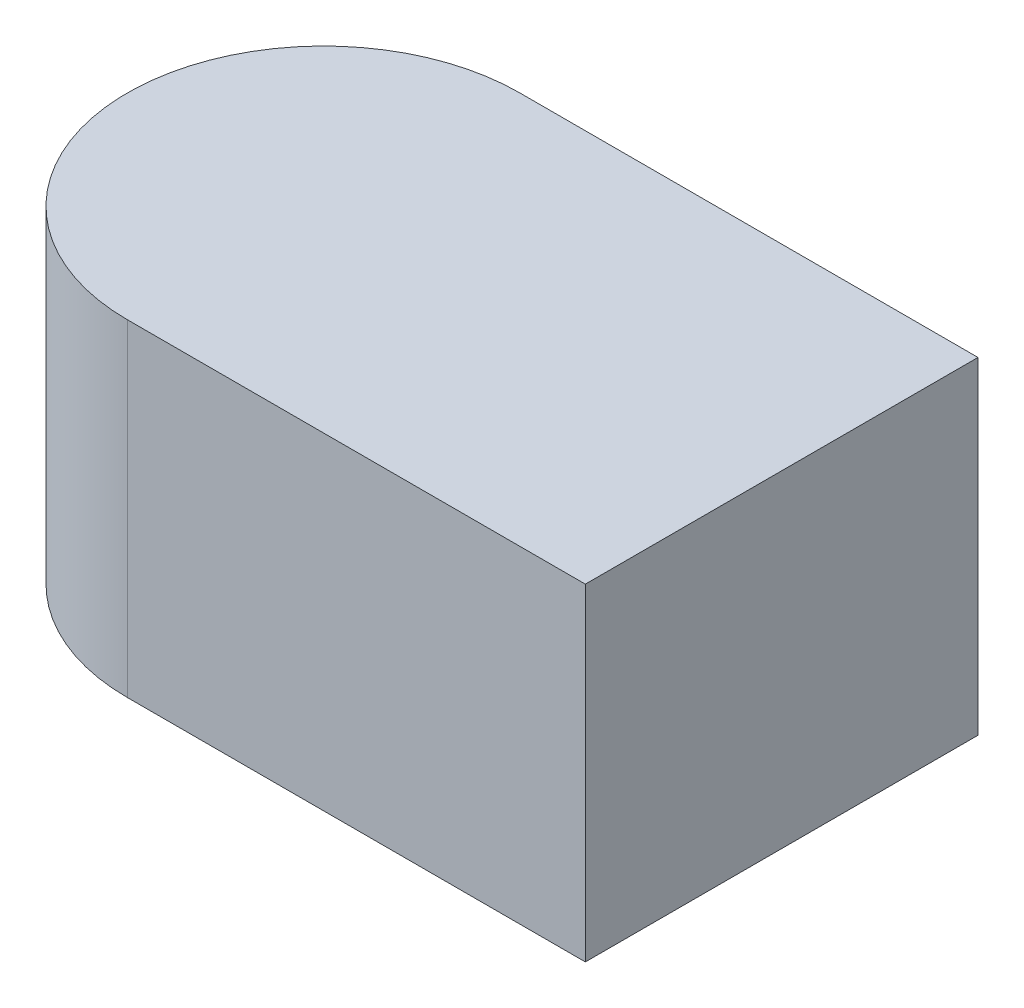
ISO-10303-21;
HEADER;
FILE_DESCRIPTION(('STEP AP214'),'2;1');
FILE_NAME('part.step','',(''),(''),'','','');
FILE_SCHEMA(('AUTOMOTIVE_DESIGN { 1 0 10303 214 1 1 1 1 }'));
ENDSEC;
DATA;
#1=APPLICATION_CONTEXT('core data for automotive mechanical design processes');
#2=APPLICATION_PROTOCOL_DEFINITION('international standard','automotive_design',2000,#1);
#3=PRODUCT_CONTEXT('',#1,'mechanical');
#4=PRODUCT('Part','Part','',(#3));
#5=PRODUCT_RELATED_PRODUCT_CATEGORY('part','',(#4));
#6=PRODUCT_DEFINITION_FORMATION('','',#4);
#7=PRODUCT_DEFINITION_CONTEXT('part definition',#1,'design');
#8=PRODUCT_DEFINITION('design','',#6,#7);
#9=PRODUCT_DEFINITION_SHAPE('','',#8);
#10=(LENGTH_UNIT() NAMED_UNIT(*) SI_UNIT(.MILLI.,.METRE.));
#11=(NAMED_UNIT(*) PLANE_ANGLE_UNIT() SI_UNIT($,.RADIAN.));
#12=(NAMED_UNIT(*) SI_UNIT($,.STERADIAN.) SOLID_ANGLE_UNIT());
#13=UNCERTAINTY_MEASURE_WITH_UNIT(LENGTH_MEASURE(1.E-05),#10,'distance_accuracy_value','');
#14=(GEOMETRIC_REPRESENTATION_CONTEXT(3) GLOBAL_UNCERTAINTY_ASSIGNED_CONTEXT((#13)) GLOBAL_UNIT_ASSIGNED_CONTEXT((#10,
#11,#12)) REPRESENTATION_CONTEXT('',''));
#15=CARTESIAN_POINT('',(0.,0.,0.));
#16=DIRECTION('',(0.,0.,1.));
#17=DIRECTION('',(1.,0.,0.));
#18=AXIS2_PLACEMENT_3D('',#15,#16,#17);
#19=CARTESIAN_POINT('',(0.,0.,0.));
#20=DIRECTION('',(0.,1.,0.));
#21=DIRECTION('',(1.,0.,0.));
#22=AXIS2_PLACEMENT_3D('',#19,#20,#21);
#23=PLANE('',#22);
#24=DIRECTION('',(0.,0.,-1.));
#25=VECTOR('',#24,1.);
#26=CARTESIAN_POINT('',(1.75,0.,1.37));
#27=LINE('',#26,#25);
#28=CARTESIAN_POINT('',(1.75,0.,1.37));
#29=VERTEX_POINT('',#28);
#30=CARTESIAN_POINT('',(1.75,0.,1.13));
#31=VERTEX_POINT('',#30);
#32=EDGE_CURVE('E11',#29,#31,#27,.T.);
#33=ORIENTED_EDGE('',*,*,#32,.F.);
#34=DIRECTION('',(1.,0.,0.));
#35=VECTOR('',#34,1.);
#36=CARTESIAN_POINT('',(1.47,0.,1.37));
#37=LINE('',#36,#35);
#38=CARTESIAN_POINT('',(1.47,0.,1.37));
#39=VERTEX_POINT('',#38);
#40=EDGE_CURVE('E24',#39,#29,#37,.T.);
#41=ORIENTED_EDGE('',*,*,#40,.F.);
#42=CARTESIAN_POINT('',(1.47,0.,1.25));
#43=DIRECTION('',(0.,1.,0.));
#44=DIRECTION('',(0.,0.,-1.));
#45=AXIS2_PLACEMENT_3D('',#42,#43,#44);
#46=CIRCLE('',#45,0.12);
#47=CARTESIAN_POINT('',(1.47,0.,1.13));
#48=VERTEX_POINT('',#47);
#49=EDGE_CURVE('E61',#48,#39,#46,.T.);
#50=ORIENTED_EDGE('',*,*,#49,.F.);
#51=DIRECTION('',(-1.,0.,0.));
#52=VECTOR('',#51,1.);
#53=CARTESIAN_POINT('',(1.75,0.,1.13));
#54=LINE('',#53,#52);
#55=EDGE_CURVE('E37',#31,#48,#54,.T.);
#56=ORIENTED_EDGE('',*,*,#55,.F.);
#57=EDGE_LOOP('',(#33,#41,#50,#56));
#58=FACE_BOUND('',#57,.T.);
#59=ADVANCED_FACE('F17',(#58),#23,.F.);
#60=CARTESIAN_POINT('',(1.75,0.,1.13));
#61=DIRECTION('',(0.,0.,-1.));
#62=DIRECTION('',(-1.,0.,0.));
#63=AXIS2_PLACEMENT_3D('',#60,#61,#62);
#64=PLANE('',#63);
#65=DIRECTION('',(0.,1.,0.));
#66=VECTOR('',#65,1.);
#67=CARTESIAN_POINT('',(1.47,0.,1.13));
#68=LINE('',#67,#66);
#69=CARTESIAN_POINT('',(1.47,0.2,1.13));
#70=VERTEX_POINT('',#69);
#71=EDGE_CURVE('E84',#48,#70,#68,.T.);
#72=ORIENTED_EDGE('',*,*,#71,.T.);
#73=DIRECTION('',(-1.,0.,0.));
#74=VECTOR('',#73,1.);
#75=CARTESIAN_POINT('',(1.75,0.2,1.13));
#76=LINE('',#75,#74);
#77=CARTESIAN_POINT('',(1.75,0.2,1.13));
#78=VERTEX_POINT('',#77);
#79=EDGE_CURVE('E74',#78,#70,#76,.T.);
#80=ORIENTED_EDGE('',*,*,#79,.F.);
#81=DIRECTION('',(0.,1.,0.));
#82=VECTOR('',#81,1.);
#83=CARTESIAN_POINT('',(1.75,0.,1.13));
#84=LINE('',#83,#82);
#85=EDGE_CURVE('E81',#31,#78,#84,.T.);
#86=ORIENTED_EDGE('',*,*,#85,.F.);
#87=ORIENTED_EDGE('',*,*,#55,.T.);
#88=EDGE_LOOP('',(#72,#80,#86,#87));
#89=FACE_BOUND('',#88,.T.);
#90=ADVANCED_FACE('F89',(#89),#64,.T.);
#91=CARTESIAN_POINT('',(1.75,0.,1.37));
#92=DIRECTION('',(1.,0.,0.));
#93=DIRECTION('',(0.,0.,-1.));
#94=AXIS2_PLACEMENT_3D('',#91,#92,#93);
#95=PLANE('',#94);
#96=ORIENTED_EDGE('',*,*,#85,.T.);
#97=DIRECTION('',(0.,0.,-1.));
#98=VECTOR('',#97,1.);
#99=CARTESIAN_POINT('',(1.75,0.2,1.37));
#100=LINE('',#99,#98);
#101=CARTESIAN_POINT('',(1.75,0.2,1.37));
#102=VERTEX_POINT('',#101);
#103=EDGE_CURVE('E79',#102,#78,#100,.T.);
#104=ORIENTED_EDGE('',*,*,#103,.F.);
#105=DIRECTION('',(0.,1.,0.));
#106=VECTOR('',#105,1.);
#107=CARTESIAN_POINT('',(1.75,0.,1.37));
#108=LINE('',#107,#106);
#109=EDGE_CURVE('E67',#29,#102,#108,.T.);
#110=ORIENTED_EDGE('',*,*,#109,.F.);
#111=ORIENTED_EDGE('',*,*,#32,.T.);
#112=EDGE_LOOP('',(#96,#104,#110,#111));
#113=FACE_BOUND('',#112,.T.);
#114=ADVANCED_FACE('F91',(#113),#95,.T.);
#115=CARTESIAN_POINT('',(1.47,0.,1.37));
#116=DIRECTION('',(0.,0.,1.));
#117=DIRECTION('',(1.,0.,0.));
#118=AXIS2_PLACEMENT_3D('',#115,#116,#117);
#119=PLANE('',#118);
#120=ORIENTED_EDGE('',*,*,#109,.T.);
#121=DIRECTION('',(1.,0.,0.));
#122=VECTOR('',#121,1.);
#123=CARTESIAN_POINT('',(1.47,0.2,1.37));
#124=LINE('',#123,#122);
#125=CARTESIAN_POINT('',(1.47,0.2,1.37));
#126=VERTEX_POINT('',#125);
#127=EDGE_CURVE('E62',#126,#102,#124,.T.);
#128=ORIENTED_EDGE('',*,*,#127,.F.);
#129=DIRECTION('',(0.,1.,0.));
#130=VECTOR('',#129,1.);
#131=CARTESIAN_POINT('',(1.47,0.,1.37));
#132=LINE('',#131,#130);
#133=EDGE_CURVE('E55',#39,#126,#132,.T.);
#134=ORIENTED_EDGE('',*,*,#133,.F.);
#135=ORIENTED_EDGE('',*,*,#40,.T.);
#136=EDGE_LOOP('',(#120,#128,#134,#135));
#137=FACE_BOUND('',#136,.T.);
#138=ADVANCED_FACE('F65',(#137),#119,.T.);
#139=CARTESIAN_POINT('',(1.47,0.,1.25));
#140=DIRECTION('',(0.,1.,0.));
#141=DIRECTION('',(1.,0.,0.));
#142=AXIS2_PLACEMENT_3D('',#139,#140,#141);
#143=CYLINDRICAL_SURFACE('',#142,0.12);
#144=ORIENTED_EDGE('',*,*,#133,.T.);
#145=CARTESIAN_POINT('',(1.47,0.2,1.25));
#146=DIRECTION('',(0.,1.,0.));
#147=DIRECTION('',(0.,0.,-1.));
#148=AXIS2_PLACEMENT_3D('',#145,#146,#147);
#149=CIRCLE('',#148,0.12);
#150=EDGE_CURVE('E60',#70,#126,#149,.T.);
#151=ORIENTED_EDGE('',*,*,#150,.F.);
#152=ORIENTED_EDGE('',*,*,#71,.F.);
#153=ORIENTED_EDGE('',*,*,#49,.T.);
#154=EDGE_LOOP('',(#144,#151,#152,#153));
#155=FACE_BOUND('',#154,.T.);
#156=ADVANCED_FACE('F57',(#155),#143,.T.);
#157=CARTESIAN_POINT('',(0.,0.2,0.));
#158=DIRECTION('',(0.,1.,0.));
#159=DIRECTION('',(1.,0.,0.));
#160=AXIS2_PLACEMENT_3D('',#157,#158,#159);
#161=PLANE('',#160);
#162=ORIENTED_EDGE('',*,*,#150,.T.);
#163=ORIENTED_EDGE('',*,*,#127,.T.);
#164=ORIENTED_EDGE('',*,*,#103,.T.);
#165=ORIENTED_EDGE('',*,*,#79,.T.);
#166=EDGE_LOOP('',(#162,#163,#164,#165));
#167=FACE_BOUND('',#166,.T.);
#168=ADVANCED_FACE('F72',(#167),#161,.T.);
#169=CLOSED_SHELL('',(#59,#90,#114,#138,#156,#168));
#170=MANIFOLD_SOLID_BREP('B1',#169);
#171=ADVANCED_BREP_SHAPE_REPRESENTATION('',(#18,#170),#14);
#172=SHAPE_DEFINITION_REPRESENTATION(#9,#171);
ENDSEC;
END-ISO-10303-21;
